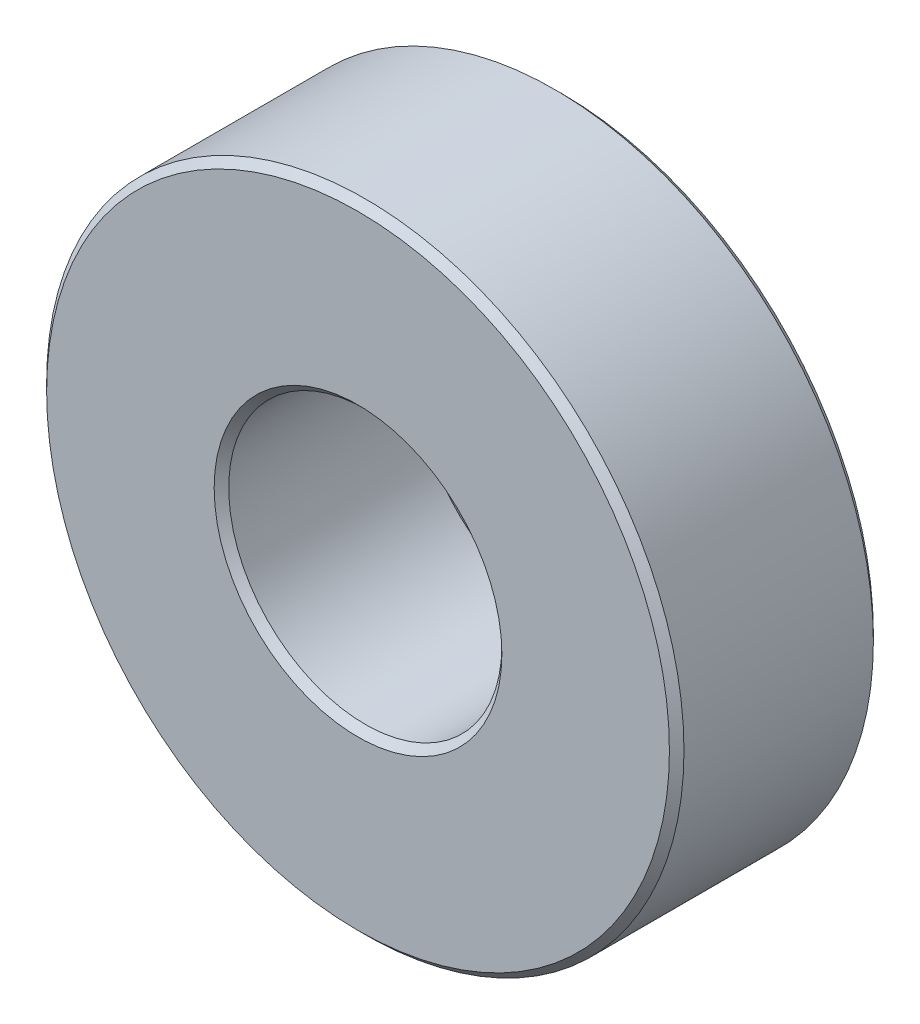
ISO-10303-21;
HEADER;
FILE_DESCRIPTION(('STEP AP214'),'2;1');
FILE_NAME('part.step','',(''),(''),'','','');
FILE_SCHEMA(('AUTOMOTIVE_DESIGN { 1 0 10303 214 1 1 1 1 }'));
ENDSEC;
DATA;
#1=APPLICATION_CONTEXT('core data for automotive mechanical design processes');
#2=APPLICATION_PROTOCOL_DEFINITION('international standard','automotive_design',2000,#1);
#3=PRODUCT_CONTEXT('',#1,'mechanical');
#4=PRODUCT('Part','Part','',(#3));
#5=PRODUCT_RELATED_PRODUCT_CATEGORY('part','',(#4));
#6=PRODUCT_DEFINITION_FORMATION('','',#4);
#7=PRODUCT_DEFINITION_CONTEXT('part definition',#1,'design');
#8=PRODUCT_DEFINITION('design','',#6,#7);
#9=PRODUCT_DEFINITION_SHAPE('','',#8);
#10=(LENGTH_UNIT() NAMED_UNIT(*) SI_UNIT(.MILLI.,.METRE.));
#11=(NAMED_UNIT(*) PLANE_ANGLE_UNIT() SI_UNIT($,.RADIAN.));
#12=(NAMED_UNIT(*) SI_UNIT($,.STERADIAN.) SOLID_ANGLE_UNIT());
#13=UNCERTAINTY_MEASURE_WITH_UNIT(LENGTH_MEASURE(1.E-05),#10,'distance_accuracy_value','');
#14=(GEOMETRIC_REPRESENTATION_CONTEXT(3) GLOBAL_UNCERTAINTY_ASSIGNED_CONTEXT((#13)) GLOBAL_UNIT_ASSIGNED_CONTEXT((#10,
#11,#12)) REPRESENTATION_CONTEXT('',''));
#15=CARTESIAN_POINT('',(0.,0.,0.));
#16=DIRECTION('',(0.,0.,1.));
#17=DIRECTION('',(1.,0.,0.));
#18=AXIS2_PLACEMENT_3D('',#15,#16,#17);
#19=CARTESIAN_POINT('',(0.,0.,7.112));
#20=DIRECTION('',(0.,0.,1.));
#21=DIRECTION('',(1.,0.,0.));
#22=AXIS2_PLACEMENT_3D('',#19,#20,#21);
#23=CYLINDRICAL_SURFACE('',#22,4.7625);
#24=CARTESIAN_POINT('',(0.,0.,6.85800000002246));
#25=DIRECTION('',(0.,0.,1.));
#26=DIRECTION('',(1.,0.,0.));
#27=AXIS2_PLACEMENT_3D('',#24,#25,#26);
#28=CIRCLE('',#27,4.76250000002664);
#29=CARTESIAN_POINT('',(4.76250000002665,0.,6.85800000002246));
#30=VERTEX_POINT('',#29);
#31=EDGE_CURVE('E33',#30,#30,#28,.T.);
#32=ORIENTED_EDGE('',*,*,#31,.T.);
#33=EDGE_LOOP('',(#32));
#34=FACE_BOUND('',#33,.T.);
#35=CARTESIAN_POINT('',(0.,0.,0.254000000040833));
#36=DIRECTION('',(0.,0.,-1.));
#37=DIRECTION('',(-1.,0.,0.));
#38=AXIS2_PLACEMENT_3D('',#35,#36,#37);
#39=CIRCLE('',#38,4.76250000002665);
#40=CARTESIAN_POINT('',(-4.76250000002665,0.,0.254000000040833));
#41=VERTEX_POINT('',#40);
#42=EDGE_CURVE('E36',#41,#41,#39,.T.);
#43=ORIENTED_EDGE('',*,*,#42,.T.);
#44=EDGE_LOOP('',(#43));
#45=FACE_BOUND('',#44,.T.);
#46=ADVANCED_FACE('F14',(#34,#45),#23,.F.);
#47=CARTESIAN_POINT('',(0.,0.,0.));
#48=DIRECTION('',(0.,0.,-1.));
#49=DIRECTION('',(-1.,0.,0.));
#50=AXIS2_PLACEMENT_3D('',#47,#48,#49);
#51=CONICAL_SURFACE('',#50,5.01650000006748,0.785398163397448);
#52=ORIENTED_EDGE('',*,*,#42,.F.);
#53=EDGE_LOOP('',(#52));
#54=FACE_BOUND('',#53,.T.);
#55=CARTESIAN_POINT('',(0.,0.,0.));
#56=DIRECTION('',(0.,0.,-1.));
#57=DIRECTION('',(-1.,0.,0.));
#58=AXIS2_PLACEMENT_3D('',#55,#56,#57);
#59=CIRCLE('',#58,5.01650000006748);
#60=CARTESIAN_POINT('',(-5.01650000006748,0.,0.));
#61=VERTEX_POINT('',#60);
#62=EDGE_CURVE('E17',#61,#61,#59,.F.);
#63=ORIENTED_EDGE('',*,*,#62,.F.);
#64=EDGE_LOOP('',(#63));
#65=FACE_BOUND('',#64,.T.);
#66=ADVANCED_FACE('F57',(#54,#65),#51,.F.);
#67=CARTESIAN_POINT('',(0.,0.,7.11200000006329));
#68=DIRECTION('',(0.,0.,1.));
#69=DIRECTION('',(1.,0.,0.));
#70=AXIS2_PLACEMENT_3D('',#67,#68,#69);
#71=CONICAL_SURFACE('',#70,5.01650000012432,0.785398163397448);
#72=CARTESIAN_POINT('',(0.,0.,7.11200000000645));
#73=DIRECTION('',(0.,0.,1.));
#74=DIRECTION('',(1.,0.,0.));
#75=AXIS2_PLACEMENT_3D('',#72,#73,#74);
#76=CIRCLE('',#75,5.01650000006748);
#77=CARTESIAN_POINT('',(5.01650000006748,0.,7.11200000000645));
#78=VERTEX_POINT('',#77);
#79=EDGE_CURVE('E47',#78,#78,#76,.T.);
#80=ORIENTED_EDGE('',*,*,#79,.T.);
#81=EDGE_LOOP('',(#80));
#82=FACE_BOUND('',#81,.T.);
#83=ORIENTED_EDGE('',*,*,#31,.F.);
#84=EDGE_LOOP('',(#83));
#85=FACE_BOUND('',#84,.T.);
#86=ADVANCED_FACE('F59',(#82,#85),#71,.F.);
#87=CARTESIAN_POINT('',(0.,0.,0.));
#88=DIRECTION('',(0.,0.,-1.));
#89=DIRECTION('',(-1.,0.,0.));
#90=AXIS2_PLACEMENT_3D('',#87,#88,#89);
#91=PLANE('',#90);
#92=ORIENTED_EDGE('',*,*,#62,.T.);
#93=EDGE_LOOP('',(#92));
#94=FACE_BOUND('',#93,.T.);
#95=CARTESIAN_POINT('',(0.,0.,0.));
#96=DIRECTION('',(0.,0.,1.));
#97=DIRECTION('',(1.,0.,0.));
#98=AXIS2_PLACEMENT_3D('',#95,#96,#97);
#99=CIRCLE('',#98,10.8585);
#100=CARTESIAN_POINT('',(10.8585,0.,0.));
#101=VERTEX_POINT('',#100);
#102=EDGE_CURVE('E45',#101,#101,#99,.T.);
#103=ORIENTED_EDGE('',*,*,#102,.F.);
#104=EDGE_LOOP('',(#103));
#105=FACE_BOUND('',#104,.T.);
#106=ADVANCED_FACE('F54',(#94,#105),#91,.T.);
#107=CARTESIAN_POINT('',(0.,0.,7.112));
#108=DIRECTION('',(0.,0.,-1.));
#109=DIRECTION('',(-1.,0.,0.));
#110=AXIS2_PLACEMENT_3D('',#107,#108,#109);
#111=PLANE('',#110);
#112=ORIENTED_EDGE('',*,*,#79,.F.);
#113=EDGE_LOOP('',(#112));
#114=FACE_BOUND('',#113,.T.);
#115=CARTESIAN_POINT('',(0.,0.,7.11199999999999));
#116=DIRECTION('',(0.,0.,-1.));
#117=DIRECTION('',(-1.,0.,0.));
#118=AXIS2_PLACEMENT_3D('',#115,#116,#117);
#119=CIRCLE('',#118,10.8585);
#120=CARTESIAN_POINT('',(-10.8585,0.,7.11199999999999));
#121=VERTEX_POINT('',#120);
#122=EDGE_CURVE('E26',#121,#121,#119,.T.);
#123=ORIENTED_EDGE('',*,*,#122,.F.);
#124=EDGE_LOOP('',(#123));
#125=FACE_BOUND('',#124,.T.);
#126=ADVANCED_FACE('F83',(#114,#125),#111,.F.);
#127=CARTESIAN_POINT('',(0.,0.,0.254000000000005));
#128=DIRECTION('',(0.,0.,1.));
#129=DIRECTION('',(1.,0.,0.));
#130=AXIS2_PLACEMENT_3D('',#127,#128,#129);
#131=CONICAL_SURFACE('',#130,11.1125,0.785398163397448);
#132=ORIENTED_EDGE('',*,*,#102,.T.);
#133=EDGE_LOOP('',(#132));
#134=FACE_BOUND('',#133,.T.);
#135=CARTESIAN_POINT('',(0.,0.,0.254));
#136=DIRECTION('',(0.,0.,1.));
#137=DIRECTION('',(1.,0.,0.));
#138=AXIS2_PLACEMENT_3D('',#135,#136,#137);
#139=CIRCLE('',#138,11.1125);
#140=CARTESIAN_POINT('',(11.1125,0.,0.254));
#141=VERTEX_POINT('',#140);
#142=EDGE_CURVE('E21',#141,#141,#139,.T.);
#143=ORIENTED_EDGE('',*,*,#142,.F.);
#144=EDGE_LOOP('',(#143));
#145=FACE_BOUND('',#144,.T.);
#146=ADVANCED_FACE('F76',(#134,#145),#131,.T.);
#147=CARTESIAN_POINT('',(0.,0.,6.85799999999999));
#148=DIRECTION('',(0.,0.,-1.));
#149=DIRECTION('',(-1.,0.,0.));
#150=AXIS2_PLACEMENT_3D('',#147,#148,#149);
#151=CONICAL_SURFACE('',#150,11.1125,0.785398163397452);
#152=CARTESIAN_POINT('',(0.,0.,6.858));
#153=DIRECTION('',(0.,0.,1.));
#154=DIRECTION('',(1.,0.,0.));
#155=AXIS2_PLACEMENT_3D('',#152,#153,#154);
#156=CIRCLE('',#155,11.1125);
#157=CARTESIAN_POINT('',(11.1125,0.,6.858));
#158=VERTEX_POINT('',#157);
#159=EDGE_CURVE('E10',#158,#158,#156,.F.);
#160=ORIENTED_EDGE('',*,*,#159,.F.);
#161=EDGE_LOOP('',(#160));
#162=FACE_BOUND('',#161,.T.);
#163=ORIENTED_EDGE('',*,*,#122,.T.);
#164=EDGE_LOOP('',(#163));
#165=FACE_BOUND('',#164,.T.);
#166=ADVANCED_FACE('F71',(#162,#165),#151,.T.);
#167=CARTESIAN_POINT('',(0.,0.,7.112));
#168=DIRECTION('',(0.,0.,1.));
#169=DIRECTION('',(1.,0.,0.));
#170=AXIS2_PLACEMENT_3D('',#167,#168,#169);
#171=CYLINDRICAL_SURFACE('',#170,11.1125);
#172=ORIENTED_EDGE('',*,*,#159,.T.);
#173=EDGE_LOOP('',(#172));
#174=FACE_BOUND('',#173,.T.);
#175=ORIENTED_EDGE('',*,*,#142,.T.);
#176=EDGE_LOOP('',(#175));
#177=FACE_BOUND('',#176,.T.);
#178=ADVANCED_FACE('F69',(#174,#177),#171,.T.);
#179=CLOSED_SHELL('',(#46,#66,#86,#106,#126,#146,#166,#178));
#180=MANIFOLD_SOLID_BREP('B1',#179);
#181=ADVANCED_BREP_SHAPE_REPRESENTATION('',(#18,#180),#14);
#182=SHAPE_DEFINITION_REPRESENTATION(#9,#181);
ENDSEC;
END-ISO-10303-21;
